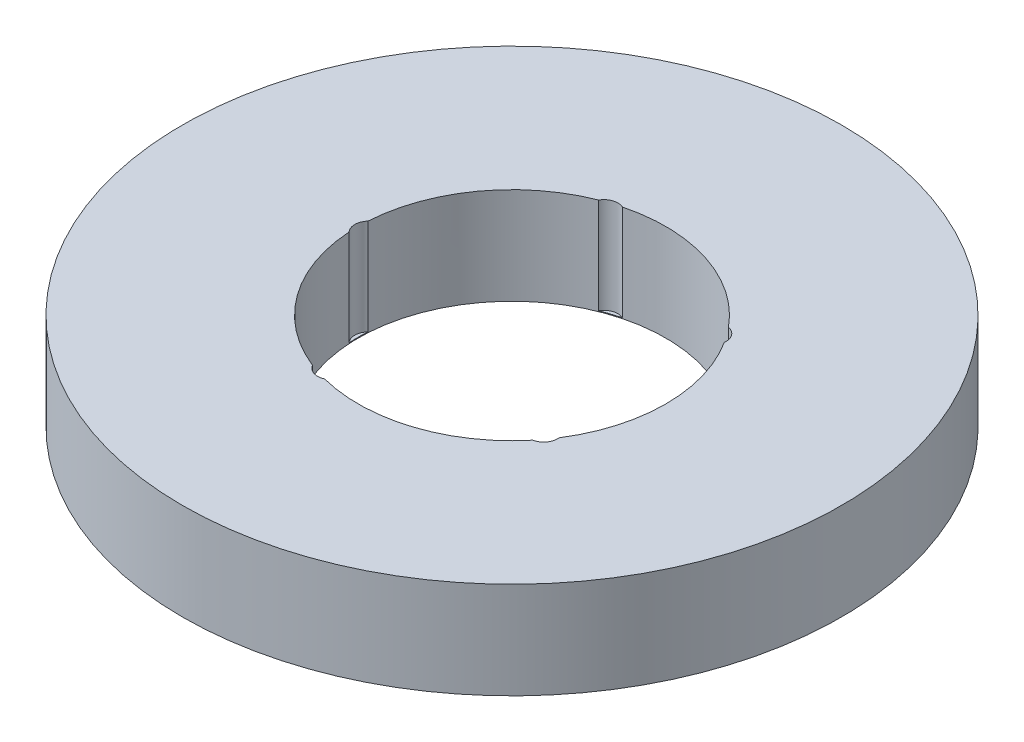
ISO-10303-21;
HEADER;
FILE_DESCRIPTION(('STEP AP214'),'2;1');
FILE_NAME('part.step','',(''),(''),'','','');
FILE_SCHEMA(('AUTOMOTIVE_DESIGN { 1 0 10303 214 1 1 1 1 }'));
ENDSEC;
DATA;
#1=APPLICATION_CONTEXT('core data for automotive mechanical design processes');
#2=APPLICATION_PROTOCOL_DEFINITION('international standard','automotive_design',2000,#1);
#3=PRODUCT_CONTEXT('',#1,'mechanical');
#4=PRODUCT('Part','Part','',(#3));
#5=PRODUCT_RELATED_PRODUCT_CATEGORY('part','',(#4));
#6=PRODUCT_DEFINITION_FORMATION('','',#4);
#7=PRODUCT_DEFINITION_CONTEXT('part definition',#1,'design');
#8=PRODUCT_DEFINITION('design','',#6,#7);
#9=PRODUCT_DEFINITION_SHAPE('','',#8);
#10=(LENGTH_UNIT() NAMED_UNIT(*) SI_UNIT(.MILLI.,.METRE.));
#11=(NAMED_UNIT(*) PLANE_ANGLE_UNIT() SI_UNIT($,.RADIAN.));
#12=(NAMED_UNIT(*) SI_UNIT($,.STERADIAN.) SOLID_ANGLE_UNIT());
#13=UNCERTAINTY_MEASURE_WITH_UNIT(LENGTH_MEASURE(1.E-05),#10,'distance_accuracy_value','');
#14=(GEOMETRIC_REPRESENTATION_CONTEXT(3) GLOBAL_UNCERTAINTY_ASSIGNED_CONTEXT((#13)) GLOBAL_UNIT_ASSIGNED_CONTEXT((#10,
#11,#12)) REPRESENTATION_CONTEXT('',''));
#15=CARTESIAN_POINT('',(0.,0.,0.));
#16=DIRECTION('',(0.,0.,1.));
#17=DIRECTION('',(1.,0.,0.));
#18=AXIS2_PLACEMENT_3D('',#15,#16,#17);
#19=CARTESIAN_POINT('',(0.,22.,0.));
#20=DIRECTION('',(0.,-1.,0.));
#21=DIRECTION('',(0.,0.,-1.));
#22=AXIS2_PLACEMENT_3D('',#19,#20,#21);
#23=CYLINDRICAL_SURFACE('',#22,75.);
#24=CARTESIAN_POINT('',(0.,22.,0.));
#25=DIRECTION('',(0.,1.,0.));
#26=DIRECTION('',(0.,0.,1.));
#27=AXIS2_PLACEMENT_3D('',#24,#25,#26);
#28=CIRCLE('',#27,75.);
#29=CARTESIAN_POINT('',(0.,22.,75.));
#30=VERTEX_POINT('',#29);
#31=EDGE_CURVE('E159',#30,#30,#28,.T.);
#32=ORIENTED_EDGE('',*,*,#31,.F.);
#33=EDGE_LOOP('',(#32));
#34=FACE_BOUND('',#33,.T.);
#35=CARTESIAN_POINT('',(0.,0.,0.));
#36=DIRECTION('',(0.,1.,0.));
#37=DIRECTION('',(0.,0.,1.));
#38=AXIS2_PLACEMENT_3D('',#35,#36,#37);
#39=CIRCLE('',#38,75.);
#40=CARTESIAN_POINT('',(0.,0.,75.));
#41=VERTEX_POINT('',#40);
#42=EDGE_CURVE('E152',#41,#41,#39,.T.);
#43=ORIENTED_EDGE('',*,*,#42,.T.);
#44=EDGE_LOOP('',(#43));
#45=FACE_BOUND('',#44,.T.);
#46=ADVANCED_FACE('F39',(#34,#45),#23,.T.);
#47=CARTESIAN_POINT('',(0.,22.,0.));
#48=DIRECTION('',(0.,1.,0.));
#49=DIRECTION('',(0.,0.,1.));
#50=AXIS2_PLACEMENT_3D('',#47,#48,#49);
#51=PLANE('',#50);
#52=CARTESIAN_POINT('',(-10.0732558140472,22.,31.0022935846484));
#53=DIRECTION('',(0.,1.,0.));
#54=DIRECTION('',(0.951056516295155,0.,0.309016994374945));
#55=AXIS2_PLACEMENT_3D('',#52,#53,#54);
#56=CIRCLE('',#55,3.17399696996564);
#57=CARTESIAN_POINT('',(-12.8385715527181,22.,32.560268433871));
#58=VERTEX_POINT('',#57);
#59=CARTESIAN_POINT('',(-8.75182302646564,22.,33.8881335236012));
#60=VERTEX_POINT('',#59);
#61=EDGE_CURVE('E192',#58,#60,#56,.T.);
#62=ORIENTED_EDGE('',*,*,#61,.F.);
#63=CARTESIAN_POINT('',(0.,22.,0.));
#64=DIRECTION('',(0.,1.,0.));
#65=DIRECTION('',(0.,0.,1.));
#66=AXIS2_PLACEMENT_3D('',#63,#64,#65);
#67=CIRCLE('',#66,35.);
#68=CARTESIAN_POINT('',(-34.9339922596411,22.,2.14853084765792));
#69=VERTEX_POINT('',#68);
#70=EDGE_CURVE('E147',#69,#58,#67,.T.);
#71=ORIENTED_EDGE('',*,*,#70,.F.);
#72=CARTESIAN_POINT('',(-32.5977405690021,22.,0.));
#73=DIRECTION('',(0.,1.,0.));
#74=DIRECTION('',(0.,0.,1.));
#75=AXIS2_PLACEMENT_3D('',#72,#73,#74);
#76=CIRCLE('',#75,3.17399696996564);
#77=CARTESIAN_POINT('',(-34.9339922596411,22.,-2.14853084765792));
#78=VERTEX_POINT('',#77);
#79=EDGE_CURVE('E154',#78,#69,#76,.T.);
#80=ORIENTED_EDGE('',*,*,#79,.F.);
#81=CARTESIAN_POINT('',(-12.8385715527186,22.,-32.5602684338709));
#82=VERTEX_POINT('',#81);
#83=EDGE_CURVE('E136',#82,#78,#67,.T.);
#84=ORIENTED_EDGE('',*,*,#83,.F.);
#85=CARTESIAN_POINT('',(-10.0732558140477,22.,-31.0022935846482));
#86=DIRECTION('',(0.,1.,0.));
#87=DIRECTION('',(-0.95105651629515,0.,0.309016994374958));
#88=AXIS2_PLACEMENT_3D('',#85,#86,#87);
#89=CIRCLE('',#88,3.17399696996564);
#90=CARTESIAN_POINT('',(-8.75182302646613,22.,-33.8881335236011));
#91=VERTEX_POINT('',#90);
#92=EDGE_CURVE('E117',#91,#82,#89,.T.);
#93=ORIENTED_EDGE('',*,*,#92,.F.);
#94=CARTESIAN_POINT('',(26.9993186730635,22.,-22.2718834226107));
#95=VERTEX_POINT('',#94);
#96=EDGE_CURVE('E133',#95,#91,#67,.T.);
#97=ORIENTED_EDGE('',*,*,#96,.F.);
#98=CARTESIAN_POINT('',(26.3721260985482,22.,-19.1604711645157));
#99=DIRECTION('',(0.,1.,0.));
#100=DIRECTION('',(-0.58778525229248,0.,-0.809016994374942));
#101=AXIS2_PLACEMENT_3D('',#98,#99,#100);
#102=CIRCLE('',#101,3.17399696996564);
#103=CARTESIAN_POINT('',(29.5250681657611,22.,-18.7954874852226));
#104=VERTEX_POINT('',#103);
#105=EDGE_CURVE('E333',#104,#95,#102,.T.);
#106=ORIENTED_EDGE('',*,*,#105,.F.);
#107=CARTESIAN_POINT('',(29.5250681657614,22.,18.7954874852222));
#108=VERTEX_POINT('',#107);
#109=EDGE_CURVE('E144',#108,#104,#67,.T.);
#110=ORIENTED_EDGE('',*,*,#109,.F.);
#111=CARTESIAN_POINT('',(26.3721260985485,22.,19.1604711645154));
#112=DIRECTION('',(0.,1.,0.));
#113=DIRECTION('',(0.587785252292469,0.,-0.809016994374951));
#114=AXIS2_PLACEMENT_3D('',#111,#112,#113);
#115=CIRCLE('',#114,3.17399696996564);
#116=CARTESIAN_POINT('',(26.9993186730639,22.,22.2718834226104));
#117=VERTEX_POINT('',#116);
#118=EDGE_CURVE('E328',#117,#108,#115,.T.);
#119=ORIENTED_EDGE('',*,*,#118,.F.);
#120=EDGE_CURVE('E146',#60,#117,#67,.T.);
#121=ORIENTED_EDGE('',*,*,#120,.F.);
#122=EDGE_LOOP('',(#62,#71,#80,#84,#93,#97,#106,#110,#119,#121));
#123=FACE_BOUND('',#122,.T.);
#124=ORIENTED_EDGE('',*,*,#31,.T.);
#125=EDGE_LOOP('',(#124));
#126=FACE_BOUND('',#125,.T.);
#127=ADVANCED_FACE('F131',(#123,#126),#51,.T.);
#128=CARTESIAN_POINT('',(0.,0.,0.));
#129=DIRECTION('',(0.,1.,0.));
#130=DIRECTION('',(0.,0.,1.));
#131=AXIS2_PLACEMENT_3D('',#128,#129,#130);
#132=PLANE('',#131);
#133=CARTESIAN_POINT('',(0.,0.,0.));
#134=DIRECTION('',(0.,1.,0.));
#135=DIRECTION('',(0.,0.,1.));
#136=AXIS2_PLACEMENT_3D('',#133,#134,#135);
#137=CIRCLE('',#136,35.);
#138=CARTESIAN_POINT('',(0.,0.,35.));
#139=VERTEX_POINT('',#138);
#140=EDGE_CURVE('E149',#139,#139,#137,.T.);
#141=ORIENTED_EDGE('',*,*,#140,.T.);
#142=EDGE_LOOP('',(#141));
#143=FACE_BOUND('',#142,.T.);
#144=ORIENTED_EDGE('',*,*,#42,.F.);
#145=EDGE_LOOP('',(#144));
#146=FACE_BOUND('',#145,.T.);
#147=ADVANCED_FACE('F209',(#143,#146),#132,.F.);
#148=CARTESIAN_POINT('',(0.,22.,0.));
#149=DIRECTION('',(0.,-1.,0.));
#150=DIRECTION('',(0.,0.,-1.));
#151=AXIS2_PLACEMENT_3D('',#148,#149,#150);
#152=CYLINDRICAL_SURFACE('',#151,35.);
#153=DIRECTION('',(0.,1.,0.));
#154=VECTOR('',#153,1.);
#155=CARTESIAN_POINT('',(-12.8385715527181,11.0837249810676,32.5602684338711));
#156=LINE('',#155,#154);
#157=CARTESIAN_POINT('',(-12.8385715527181,0.167449962135156,32.560268433871));
#158=VERTEX_POINT('',#157);
#159=EDGE_CURVE('E11',#158,#58,#156,.T.);
#160=ORIENTED_EDGE('',*,*,#159,.F.);
#161=CARTESIAN_POINT('',(0.,0.167449962135156,0.));
#162=DIRECTION('',(0.,1.,0.));
#163=DIRECTION('',(0.,0.,1.));
#164=AXIS2_PLACEMENT_3D('',#161,#162,#163);
#165=CIRCLE('',#164,35.);
#166=CARTESIAN_POINT('',(-8.75182302646564,0.167449962135156,33.8881335236012));
#167=VERTEX_POINT('',#166);
#168=EDGE_CURVE('E187',#158,#167,#165,.T.);
#169=ORIENTED_EDGE('',*,*,#168,.T.);
#170=DIRECTION('',(0.,1.,0.));
#171=VECTOR('',#170,1.);
#172=CARTESIAN_POINT('',(-8.7518230264657,11.0837249810676,33.8881335236013));
#173=LINE('',#172,#171);
#174=EDGE_CURVE('E46',#60,#167,#173,.F.);
#175=ORIENTED_EDGE('',*,*,#174,.F.);
#176=ORIENTED_EDGE('',*,*,#120,.T.);
#177=DIRECTION('',(0.,1.,0.));
#178=VECTOR('',#177,1.);
#179=CARTESIAN_POINT('',(26.9993186730639,11.0837249810676,22.2718834226103));
#180=LINE('',#179,#178);
#181=CARTESIAN_POINT('',(26.9993186730639,0.167449962135156,22.2718834226104));
#182=VERTEX_POINT('',#181);
#183=EDGE_CURVE('E186',#182,#117,#180,.T.);
#184=ORIENTED_EDGE('',*,*,#183,.F.);
#185=CARTESIAN_POINT('',(0.,0.167449962135156,0.));
#186=DIRECTION('',(0.,1.,0.));
#187=DIRECTION('',(0.,0.,1.));
#188=AXIS2_PLACEMENT_3D('',#185,#186,#187);
#189=CIRCLE('',#188,35.);
#190=CARTESIAN_POINT('',(29.5250681657614,0.167449962135156,18.7954874852222));
#191=VERTEX_POINT('',#190);
#192=EDGE_CURVE('E182',#182,#191,#189,.T.);
#193=ORIENTED_EDGE('',*,*,#192,.T.);
#194=DIRECTION('',(0.,1.,0.));
#195=VECTOR('',#194,1.);
#196=CARTESIAN_POINT('',(29.5250681657614,11.0837249810676,18.7954874852223));
#197=LINE('',#196,#195);
#198=EDGE_CURVE('E184',#108,#191,#197,.F.);
#199=ORIENTED_EDGE('',*,*,#198,.F.);
#200=ORIENTED_EDGE('',*,*,#109,.T.);
#201=DIRECTION('',(0.,1.,0.));
#202=VECTOR('',#201,1.);
#203=CARTESIAN_POINT('',(29.5250681657611,11.0837249810676,-18.7954874852227));
#204=LINE('',#203,#202);
#205=CARTESIAN_POINT('',(29.5250681657611,0.167449962135156,-18.7954874852226));
#206=VERTEX_POINT('',#205);
#207=EDGE_CURVE('E178',#206,#104,#204,.T.);
#208=ORIENTED_EDGE('',*,*,#207,.F.);
#209=CARTESIAN_POINT('',(0.,0.167449962135156,0.));
#210=DIRECTION('',(0.,1.,0.));
#211=DIRECTION('',(0.,0.,1.));
#212=AXIS2_PLACEMENT_3D('',#209,#210,#211);
#213=CIRCLE('',#212,35.);
#214=CARTESIAN_POINT('',(26.9993186730635,0.167449962135156,-22.2718834226107));
#215=VERTEX_POINT('',#214);
#216=EDGE_CURVE('E123',#206,#215,#213,.T.);
#217=ORIENTED_EDGE('',*,*,#216,.T.);
#218=DIRECTION('',(0.,1.,0.));
#219=VECTOR('',#218,1.);
#220=CARTESIAN_POINT('',(26.9993186730636,11.0837249810676,-22.2718834226107));
#221=LINE('',#220,#219);
#222=EDGE_CURVE('E145',#95,#215,#221,.F.);
#223=ORIENTED_EDGE('',*,*,#222,.F.);
#224=ORIENTED_EDGE('',*,*,#96,.T.);
#225=DIRECTION('',(0.,1.,0.));
#226=VECTOR('',#225,1.);
#227=CARTESIAN_POINT('',(-8.75182302646618,11.0837249810676,-33.8881335236011));
#228=LINE('',#227,#226);
#229=CARTESIAN_POINT('',(-8.75182302646613,0.167449962135156,-33.8881335236011));
#230=VERTEX_POINT('',#229);
#231=EDGE_CURVE('E111',#230,#91,#228,.T.);
#232=ORIENTED_EDGE('',*,*,#231,.F.);
#233=CARTESIAN_POINT('',(0.,0.167449962135156,0.));
#234=DIRECTION('',(0.,1.,0.));
#235=DIRECTION('',(0.,0.,1.));
#236=AXIS2_PLACEMENT_3D('',#233,#234,#235);
#237=CIRCLE('',#236,35.);
#238=CARTESIAN_POINT('',(-12.8385715527186,0.167449962135156,-32.5602684338709));
#239=VERTEX_POINT('',#238);
#240=EDGE_CURVE('E173',#230,#239,#237,.T.);
#241=ORIENTED_EDGE('',*,*,#240,.T.);
#242=DIRECTION('',(0.,1.,0.));
#243=VECTOR('',#242,1.);
#244=CARTESIAN_POINT('',(-12.8385715527185,11.0837249810676,-32.5602684338709));
#245=LINE('',#244,#243);
#246=EDGE_CURVE('E124',#82,#239,#245,.F.);
#247=ORIENTED_EDGE('',*,*,#246,.F.);
#248=ORIENTED_EDGE('',*,*,#83,.T.);
#249=DIRECTION('',(0.,1.,0.));
#250=VECTOR('',#249,1.);
#251=CARTESIAN_POINT('',(-34.9339922596411,11.0837249810676,-2.14853084765789));
#252=LINE('',#251,#250);
#253=CARTESIAN_POINT('',(-34.9339922596411,0.167449962135156,-2.14853084765792));
#254=VERTEX_POINT('',#253);
#255=EDGE_CURVE('E171',#254,#78,#252,.T.);
#256=ORIENTED_EDGE('',*,*,#255,.F.);
#257=CARTESIAN_POINT('',(0.,0.167449962135156,0.));
#258=DIRECTION('',(0.,1.,0.));
#259=DIRECTION('',(0.,0.,1.));
#260=AXIS2_PLACEMENT_3D('',#257,#258,#259);
#261=CIRCLE('',#260,35.);
#262=CARTESIAN_POINT('',(-34.9339922596411,0.167449962135156,2.14853084765792));
#263=VERTEX_POINT('',#262);
#264=EDGE_CURVE('E162',#254,#263,#261,.T.);
#265=ORIENTED_EDGE('',*,*,#264,.T.);
#266=DIRECTION('',(0.,1.,0.));
#267=VECTOR('',#266,1.);
#268=CARTESIAN_POINT('',(-34.9339922596411,11.0837249810676,2.14853084765789));
#269=LINE('',#268,#267);
#270=EDGE_CURVE('E169',#69,#263,#269,.F.);
#271=ORIENTED_EDGE('',*,*,#270,.F.);
#272=ORIENTED_EDGE('',*,*,#70,.T.);
#273=EDGE_LOOP('',(#160,#169,#175,#176,#184,#193,#199,#200,#208,#217,#223,#224,#232,#241,#247,
#248,#256,#265,#271,#272));
#274=FACE_BOUND('',#273,.T.);
#275=ORIENTED_EDGE('',*,*,#140,.F.);
#276=EDGE_LOOP('',(#275));
#277=FACE_BOUND('',#276,.T.);
#278=ADVANCED_FACE('F139',(#274,#277),#152,.F.);
#279=CARTESIAN_POINT('',(-32.5977405690021,0.167449962135156,0.));
#280=DIRECTION('',(0.,1.,0.));
#281=DIRECTION('',(0.,0.,1.));
#282=AXIS2_PLACEMENT_3D('',#279,#280,#281);
#283=CYLINDRICAL_SURFACE('',#282,3.17399696996564);
#284=ORIENTED_EDGE('',*,*,#255,.T.);
#285=ORIENTED_EDGE('',*,*,#79,.T.);
#286=ORIENTED_EDGE('',*,*,#270,.T.);
#287=CARTESIAN_POINT('',(-32.5977405690021,0.167449962135156,0.));
#288=DIRECTION('',(0.,1.,0.));
#289=DIRECTION('',(0.,0.,1.));
#290=AXIS2_PLACEMENT_3D('',#287,#288,#289);
#291=CIRCLE('',#290,3.17399696996564);
#292=EDGE_CURVE('E157',#254,#263,#291,.T.);
#293=ORIENTED_EDGE('',*,*,#292,.F.);
#294=EDGE_LOOP('',(#284,#285,#286,#293));
#295=FACE_BOUND('',#294,.T.);
#296=ADVANCED_FACE('F222',(#295),#283,.F.);
#297=CARTESIAN_POINT('',(-32.5977405690021,0.167449962135156,0.));
#298=DIRECTION('',(0.,1.,0.));
#299=DIRECTION('',(0.,0.,1.));
#300=AXIS2_PLACEMENT_3D('',#297,#298,#299);
#301=PLANE('',#300);
#302=ORIENTED_EDGE('',*,*,#292,.T.);
#303=ORIENTED_EDGE('',*,*,#264,.F.);
#304=EDGE_LOOP('',(#302,#303));
#305=FACE_BOUND('',#304,.T.);
#306=ADVANCED_FACE('F223',(#305),#301,.T.);
#307=CARTESIAN_POINT('',(-10.0732558140477,0.167449962135156,-31.0022935846482));
#308=DIRECTION('',(0.,1.,0.));
#309=DIRECTION('',(0.,0.,1.));
#310=AXIS2_PLACEMENT_3D('',#307,#308,#309);
#311=CYLINDRICAL_SURFACE('',#310,3.17399696996564);
#312=ORIENTED_EDGE('',*,*,#231,.T.);
#313=ORIENTED_EDGE('',*,*,#92,.T.);
#314=ORIENTED_EDGE('',*,*,#246,.T.);
#315=CARTESIAN_POINT('',(-10.0732558140477,0.167449962135156,-31.0022935846482));
#316=DIRECTION('',(0.,1.,0.));
#317=DIRECTION('',(-0.95105651629515,0.,0.309016994374958));
#318=AXIS2_PLACEMENT_3D('',#315,#316,#317);
#319=CIRCLE('',#318,3.17399696996564);
#320=EDGE_CURVE('E119',#230,#239,#319,.T.);
#321=ORIENTED_EDGE('',*,*,#320,.F.);
#322=EDGE_LOOP('',(#312,#313,#314,#321));
#323=FACE_BOUND('',#322,.T.);
#324=ADVANCED_FACE('F116',(#323),#311,.F.);
#325=CARTESIAN_POINT('',(-10.0732558140477,0.167449962135156,-31.0022935846482));
#326=DIRECTION('',(0.,1.,0.));
#327=DIRECTION('',(-0.95105651629515,0.,0.309016994374958));
#328=AXIS2_PLACEMENT_3D('',#325,#326,#327);
#329=PLANE('',#328);
#330=ORIENTED_EDGE('',*,*,#320,.T.);
#331=ORIENTED_EDGE('',*,*,#240,.F.);
#332=EDGE_LOOP('',(#330,#331));
#333=FACE_BOUND('',#332,.T.);
#334=ADVANCED_FACE('F235',(#333),#329,.T.);
#335=CARTESIAN_POINT('',(26.3721260985482,0.167449962135156,-19.1604711645157));
#336=DIRECTION('',(0.,1.,0.));
#337=DIRECTION('',(0.,0.,1.));
#338=AXIS2_PLACEMENT_3D('',#335,#336,#337);
#339=CYLINDRICAL_SURFACE('',#338,3.17399696996564);
#340=ORIENTED_EDGE('',*,*,#207,.T.);
#341=ORIENTED_EDGE('',*,*,#105,.T.);
#342=ORIENTED_EDGE('',*,*,#222,.T.);
#343=CARTESIAN_POINT('',(26.3721260985482,0.167449962135156,-19.1604711645157));
#344=DIRECTION('',(0.,1.,0.));
#345=DIRECTION('',(-0.58778525229248,0.,-0.809016994374942));
#346=AXIS2_PLACEMENT_3D('',#343,#344,#345);
#347=CIRCLE('',#346,3.17399696996564);
#348=EDGE_CURVE('E335',#206,#215,#347,.T.);
#349=ORIENTED_EDGE('',*,*,#348,.F.);
#350=EDGE_LOOP('',(#340,#341,#342,#349));
#351=FACE_BOUND('',#350,.T.);
#352=ADVANCED_FACE('F234',(#351),#339,.F.);
#353=CARTESIAN_POINT('',(26.3721260985482,0.167449962135156,-19.1604711645157));
#354=DIRECTION('',(0.,1.,0.));
#355=DIRECTION('',(-0.58778525229248,0.,-0.809016994374942));
#356=AXIS2_PLACEMENT_3D('',#353,#354,#355);
#357=PLANE('',#356);
#358=ORIENTED_EDGE('',*,*,#348,.T.);
#359=ORIENTED_EDGE('',*,*,#216,.F.);
#360=EDGE_LOOP('',(#358,#359));
#361=FACE_BOUND('',#360,.T.);
#362=ADVANCED_FACE('F239',(#361),#357,.T.);
#363=CARTESIAN_POINT('',(26.3721260985485,0.167449962135156,19.1604711645154));
#364=DIRECTION('',(0.,1.,0.));
#365=DIRECTION('',(0.,0.,1.));
#366=AXIS2_PLACEMENT_3D('',#363,#364,#365);
#367=CYLINDRICAL_SURFACE('',#366,3.17399696996564);
#368=ORIENTED_EDGE('',*,*,#183,.T.);
#369=ORIENTED_EDGE('',*,*,#118,.T.);
#370=ORIENTED_EDGE('',*,*,#198,.T.);
#371=CARTESIAN_POINT('',(26.3721260985485,0.167449962135156,19.1604711645154));
#372=DIRECTION('',(0.,1.,0.));
#373=DIRECTION('',(0.587785252292469,0.,-0.809016994374951));
#374=AXIS2_PLACEMENT_3D('',#371,#372,#373);
#375=CIRCLE('',#374,3.17399696996564);
#376=EDGE_CURVE('E56',#182,#191,#375,.T.);
#377=ORIENTED_EDGE('',*,*,#376,.F.);
#378=EDGE_LOOP('',(#368,#369,#370,#377));
#379=FACE_BOUND('',#378,.T.);
#380=ADVANCED_FACE('F242',(#379),#367,.F.);
#381=CARTESIAN_POINT('',(26.3721260985485,0.167449962135156,19.1604711645154));
#382=DIRECTION('',(0.,1.,0.));
#383=DIRECTION('',(0.587785252292469,0.,-0.809016994374951));
#384=AXIS2_PLACEMENT_3D('',#381,#382,#383);
#385=PLANE('',#384);
#386=ORIENTED_EDGE('',*,*,#376,.T.);
#387=ORIENTED_EDGE('',*,*,#192,.F.);
#388=EDGE_LOOP('',(#386,#387));
#389=FACE_BOUND('',#388,.T.);
#390=ADVANCED_FACE('F205',(#389),#385,.T.);
#391=CARTESIAN_POINT('',(-10.0732558140472,0.167449962135156,31.0022935846484));
#392=DIRECTION('',(0.,1.,0.));
#393=DIRECTION('',(0.,0.,1.));
#394=AXIS2_PLACEMENT_3D('',#391,#392,#393);
#395=CYLINDRICAL_SURFACE('',#394,3.17399696996564);
#396=ORIENTED_EDGE('',*,*,#159,.T.);
#397=ORIENTED_EDGE('',*,*,#61,.T.);
#398=ORIENTED_EDGE('',*,*,#174,.T.);
#399=CARTESIAN_POINT('',(-10.0732558140472,0.167449962135156,31.0022935846484));
#400=DIRECTION('',(0.,1.,0.));
#401=DIRECTION('',(0.951056516295155,0.,0.309016994374945));
#402=AXIS2_PLACEMENT_3D('',#399,#400,#401);
#403=CIRCLE('',#402,3.17399696996564);
#404=EDGE_CURVE('E55',#158,#167,#403,.T.);
#405=ORIENTED_EDGE('',*,*,#404,.F.);
#406=EDGE_LOOP('',(#396,#397,#398,#405));
#407=FACE_BOUND('',#406,.T.);
#408=ADVANCED_FACE('F195',(#407),#395,.F.);
#409=CARTESIAN_POINT('',(-10.0732558140472,0.167449962135156,31.0022935846484));
#410=DIRECTION('',(0.,1.,0.));
#411=DIRECTION('',(0.951056516295155,0.,0.309016994374945));
#412=AXIS2_PLACEMENT_3D('',#409,#410,#411);
#413=PLANE('',#412);
#414=ORIENTED_EDGE('',*,*,#404,.T.);
#415=ORIENTED_EDGE('',*,*,#168,.F.);
#416=EDGE_LOOP('',(#414,#415));
#417=FACE_BOUND('',#416,.T.);
#418=ADVANCED_FACE('F198',(#417),#413,.T.);
#419=CLOSED_SHELL('',(#46,#127,#147,#278,#296,#306,#324,#334,#352,#362,#380,#390,#408,#418));
#420=MANIFOLD_SOLID_BREP('B2',#419);
#421=ADVANCED_BREP_SHAPE_REPRESENTATION('',(#18,#420),#14);
#422=SHAPE_DEFINITION_REPRESENTATION(#9,#421);
ENDSEC;
END-ISO-10303-21;
